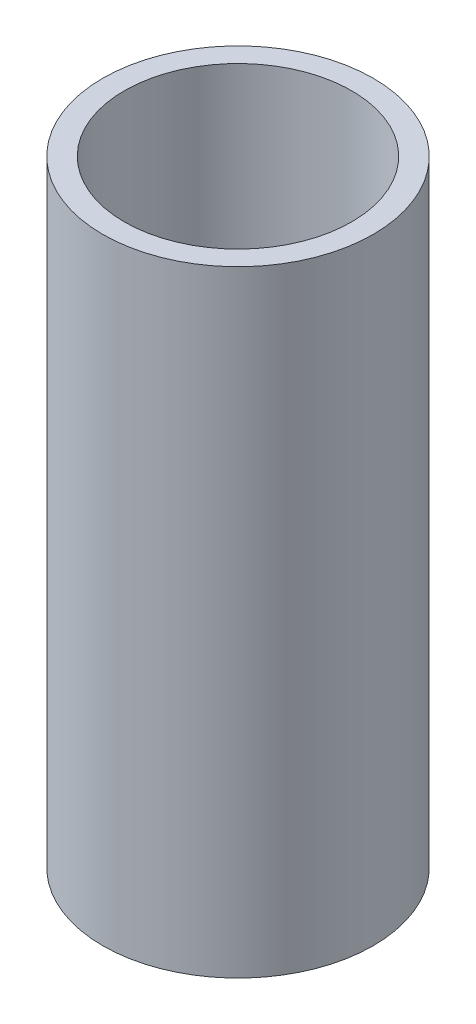
ISO-10303-21;
HEADER;
FILE_DESCRIPTION(('STEP AP214'),'2;1');
FILE_NAME('part.step','',(''),(''),'','','');
FILE_SCHEMA(('AUTOMOTIVE_DESIGN { 1 0 10303 214 1 1 1 1 }'));
ENDSEC;
DATA;
#1=APPLICATION_CONTEXT('core data for automotive mechanical design processes');
#2=APPLICATION_PROTOCOL_DEFINITION('international standard','automotive_design',2000,#1);
#3=PRODUCT_CONTEXT('',#1,'mechanical');
#4=PRODUCT('Part','Part','',(#3));
#5=PRODUCT_RELATED_PRODUCT_CATEGORY('part','',(#4));
#6=PRODUCT_DEFINITION_FORMATION('','',#4);
#7=PRODUCT_DEFINITION_CONTEXT('part definition',#1,'design');
#8=PRODUCT_DEFINITION('design','',#6,#7);
#9=PRODUCT_DEFINITION_SHAPE('','',#8);
#10=(LENGTH_UNIT() NAMED_UNIT(*) SI_UNIT(.MILLI.,.METRE.));
#11=(NAMED_UNIT(*) PLANE_ANGLE_UNIT() SI_UNIT($,.RADIAN.));
#12=(NAMED_UNIT(*) SI_UNIT($,.STERADIAN.) SOLID_ANGLE_UNIT());
#13=UNCERTAINTY_MEASURE_WITH_UNIT(LENGTH_MEASURE(1.E-05),#10,'distance_accuracy_value','');
#14=(GEOMETRIC_REPRESENTATION_CONTEXT(3) GLOBAL_UNCERTAINTY_ASSIGNED_CONTEXT((#13)) GLOBAL_UNIT_ASSIGNED_CONTEXT((#10,
#11,#12)) REPRESENTATION_CONTEXT('',''));
#15=CARTESIAN_POINT('',(0.,0.,0.));
#16=DIRECTION('',(0.,0.,1.));
#17=DIRECTION('',(1.,0.,0.));
#18=AXIS2_PLACEMENT_3D('',#15,#16,#17);
#19=CARTESIAN_POINT('',(0.,148.045834831208,0.));
#20=DIRECTION('',(0.,-1.,0.));
#21=DIRECTION('',(0.,0.,-1.));
#22=AXIS2_PLACEMENT_3D('',#19,#20,#21);
#23=CYLINDRICAL_SURFACE('',#22,32.5);
#24=CARTESIAN_POINT('',(0.,148.045834831208,0.));
#25=DIRECTION('',(0.,1.,0.));
#26=DIRECTION('',(0.,0.,1.));
#27=AXIS2_PLACEMENT_3D('',#24,#25,#26);
#28=CIRCLE('',#27,32.5);
#29=CARTESIAN_POINT('',(0.,148.045834831208,32.5));
#30=VERTEX_POINT('',#29);
#31=EDGE_CURVE('E10',#30,#30,#28,.T.);
#32=ORIENTED_EDGE('',*,*,#31,.F.);
#33=EDGE_LOOP('',(#32));
#34=FACE_BOUND('',#33,.T.);
#35=CARTESIAN_POINT('',(0.,0.,0.));
#36=DIRECTION('',(0.,1.,0.));
#37=DIRECTION('',(0.,0.,1.));
#38=AXIS2_PLACEMENT_3D('',#35,#36,#37);
#39=CIRCLE('',#38,32.5);
#40=CARTESIAN_POINT('',(0.,0.,32.5));
#41=VERTEX_POINT('',#40);
#42=EDGE_CURVE('E37',#41,#41,#39,.T.);
#43=ORIENTED_EDGE('',*,*,#42,.T.);
#44=EDGE_LOOP('',(#43));
#45=FACE_BOUND('',#44,.T.);
#46=ADVANCED_FACE('F40',(#34,#45),#23,.T.);
#47=CARTESIAN_POINT('',(0.,148.045834831208,0.));
#48=DIRECTION('',(0.,1.,0.));
#49=DIRECTION('',(0.,0.,1.));
#50=AXIS2_PLACEMENT_3D('',#47,#48,#49);
#51=PLANE('',#50);
#52=CARTESIAN_POINT('',(0.,148.045834831208,0.));
#53=DIRECTION('',(0.,1.,0.));
#54=DIRECTION('',(0.,0.,1.));
#55=AXIS2_PLACEMENT_3D('',#52,#53,#54);
#56=CIRCLE('',#55,27.3120668405328);
#57=CARTESIAN_POINT('',(0.,148.045834831208,27.3120668405328));
#58=VERTEX_POINT('',#57);
#59=EDGE_CURVE('E50',#58,#58,#56,.T.);
#60=ORIENTED_EDGE('',*,*,#59,.F.);
#61=EDGE_LOOP('',(#60));
#62=FACE_BOUND('',#61,.T.);
#63=ORIENTED_EDGE('',*,*,#31,.T.);
#64=EDGE_LOOP('',(#63));
#65=FACE_BOUND('',#64,.T.);
#66=ADVANCED_FACE('F59',(#62,#65),#51,.T.);
#67=CARTESIAN_POINT('',(0.,0.,0.));
#68=DIRECTION('',(0.,1.,0.));
#69=DIRECTION('',(0.,0.,1.));
#70=AXIS2_PLACEMENT_3D('',#67,#68,#69);
#71=PLANE('',#70);
#72=CARTESIAN_POINT('',(0.,0.,0.));
#73=DIRECTION('',(0.,1.,0.));
#74=DIRECTION('',(0.,0.,1.));
#75=AXIS2_PLACEMENT_3D('',#72,#73,#74);
#76=CIRCLE('',#75,27.3120668405328);
#77=CARTESIAN_POINT('',(0.,0.,27.3120668405328));
#78=VERTEX_POINT('',#77);
#79=EDGE_CURVE('E47',#78,#78,#76,.T.);
#80=ORIENTED_EDGE('',*,*,#79,.T.);
#81=EDGE_LOOP('',(#80));
#82=FACE_BOUND('',#81,.T.);
#83=ORIENTED_EDGE('',*,*,#42,.F.);
#84=EDGE_LOOP('',(#83));
#85=FACE_BOUND('',#84,.T.);
#86=ADVANCED_FACE('F58',(#82,#85),#71,.F.);
#87=CARTESIAN_POINT('',(0.,148.045834831208,0.));
#88=DIRECTION('',(0.,-1.,0.));
#89=DIRECTION('',(0.,0.,-1.));
#90=AXIS2_PLACEMENT_3D('',#87,#88,#89);
#91=CYLINDRICAL_SURFACE('',#90,27.3120668405328);
#92=ORIENTED_EDGE('',*,*,#59,.T.);
#93=EDGE_LOOP('',(#92));
#94=FACE_BOUND('',#93,.T.);
#95=ORIENTED_EDGE('',*,*,#79,.F.);
#96=EDGE_LOOP('',(#95));
#97=FACE_BOUND('',#96,.T.);
#98=ADVANCED_FACE('F54',(#94,#97),#91,.F.);
#99=CLOSED_SHELL('',(#46,#66,#86,#98));
#100=MANIFOLD_SOLID_BREP('B2',#99);
#101=ADVANCED_BREP_SHAPE_REPRESENTATION('',(#18,#100),#14);
#102=SHAPE_DEFINITION_REPRESENTATION(#9,#101);
ENDSEC;
END-ISO-10303-21;
